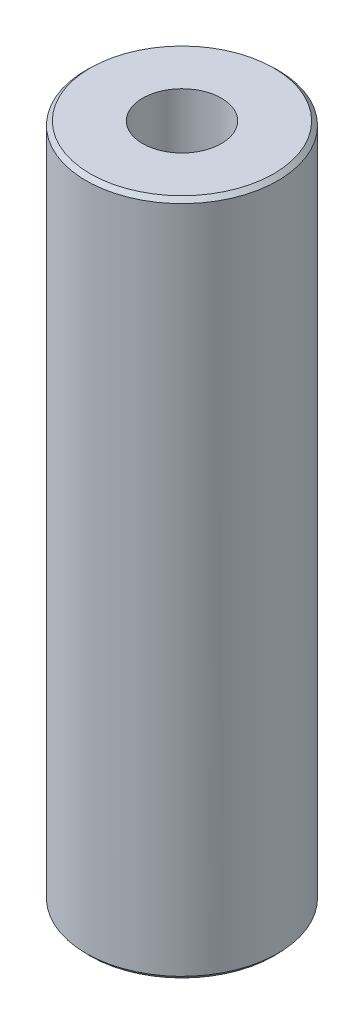
ISO-10303-21;
HEADER;
FILE_DESCRIPTION(('STEP AP214'),'2;1');
FILE_NAME('part.step','',(''),(''),'','','');
FILE_SCHEMA(('AUTOMOTIVE_DESIGN { 1 0 10303 214 1 1 1 1 }'));
ENDSEC;
DATA;
#1=APPLICATION_CONTEXT('core data for automotive mechanical design processes');
#2=APPLICATION_PROTOCOL_DEFINITION('international standard','automotive_design',2000,#1);
#3=PRODUCT_CONTEXT('',#1,'mechanical');
#4=PRODUCT('Part','Part','',(#3));
#5=PRODUCT_RELATED_PRODUCT_CATEGORY('part','',(#4));
#6=PRODUCT_DEFINITION_FORMATION('','',#4);
#7=PRODUCT_DEFINITION_CONTEXT('part definition',#1,'design');
#8=PRODUCT_DEFINITION('design','',#6,#7);
#9=PRODUCT_DEFINITION_SHAPE('','',#8);
#10=(LENGTH_UNIT() NAMED_UNIT(*) SI_UNIT(.MILLI.,.METRE.));
#11=(NAMED_UNIT(*) PLANE_ANGLE_UNIT() SI_UNIT($,.RADIAN.));
#12=(NAMED_UNIT(*) SI_UNIT($,.STERADIAN.) SOLID_ANGLE_UNIT());
#13=UNCERTAINTY_MEASURE_WITH_UNIT(LENGTH_MEASURE(1.E-05),#10,'distance_accuracy_value','');
#14=(GEOMETRIC_REPRESENTATION_CONTEXT(3) GLOBAL_UNCERTAINTY_ASSIGNED_CONTEXT((#13)) GLOBAL_UNIT_ASSIGNED_CONTEXT((#10,
#11,#12)) REPRESENTATION_CONTEXT('',''));
#15=CARTESIAN_POINT('',(0.,0.,0.));
#16=DIRECTION('',(0.,0.,1.));
#17=DIRECTION('',(1.,0.,0.));
#18=AXIS2_PLACEMENT_3D('',#15,#16,#17);
#19=CARTESIAN_POINT('',(0.,317.914214538559,0.));
#20=DIRECTION('',(0.,-1.,0.));
#21=DIRECTION('',(0.,0.,-1.));
#22=AXIS2_PLACEMENT_3D('',#19,#20,#21);
#23=CYLINDRICAL_SURFACE('',#22,45.);
#24=CARTESIAN_POINT('',(0.,316.079445148063,0.));
#25=DIRECTION('',(0.,1.,0.));
#26=DIRECTION('',(0.,0.,1.));
#27=AXIS2_PLACEMENT_3D('',#24,#25,#26);
#28=CIRCLE('',#27,45.);
#29=CARTESIAN_POINT('',(0.,316.079445148063,-45.));
#30=VERTEX_POINT('',#29);
#31=EDGE_CURVE('E50',#30,#30,#28,.F.);
#32=ORIENTED_EDGE('',*,*,#31,.T.);
#33=EDGE_LOOP('',(#32));
#34=FACE_BOUND('',#33,.T.);
#35=CARTESIAN_POINT('',(0.,1.95768399848506,0.));
#36=DIRECTION('',(0.,1.,0.));
#37=DIRECTION('',(0.,0.,1.));
#38=AXIS2_PLACEMENT_3D('',#35,#36,#37);
#39=CIRCLE('',#38,45.);
#40=CARTESIAN_POINT('',(0.,1.95768399848506,45.));
#41=VERTEX_POINT('',#40);
#42=EDGE_CURVE('E51',#41,#41,#39,.T.);
#43=ORIENTED_EDGE('',*,*,#42,.T.);
#44=EDGE_LOOP('',(#43));
#45=FACE_BOUND('',#44,.T.);
#46=ADVANCED_FACE('F39',(#34,#45),#23,.T.);
#47=CARTESIAN_POINT('',(0.,317.914214538559,0.));
#48=DIRECTION('',(0.,1.,0.));
#49=DIRECTION('',(0.,0.,1.));
#50=AXIS2_PLACEMENT_3D('',#47,#48,#49);
#51=PLANE('',#50);
#52=CARTESIAN_POINT('',(0.,317.914214538559,0.));
#53=DIRECTION('',(0.,1.,0.));
#54=DIRECTION('',(0.,0.,1.));
#55=AXIS2_PLACEMENT_3D('',#52,#53,#54);
#56=CIRCLE('',#55,43.0423160015149);
#57=CARTESIAN_POINT('',(0.,317.914214538559,-43.042316001515));
#58=VERTEX_POINT('',#57);
#59=EDGE_CURVE('E54',#58,#58,#56,.T.);
#60=ORIENTED_EDGE('',*,*,#59,.T.);
#61=EDGE_LOOP('',(#60));
#62=FACE_BOUND('',#61,.T.);
#63=CARTESIAN_POINT('',(0.,317.914214538559,0.));
#64=DIRECTION('',(0.,1.,0.));
#65=DIRECTION('',(0.,0.,1.));
#66=AXIS2_PLACEMENT_3D('',#63,#64,#65);
#67=CIRCLE('',#66,18.4985503559406);
#68=CARTESIAN_POINT('',(0.,317.914214538559,18.4985503559406));
#69=VERTEX_POINT('',#68);
#70=EDGE_CURVE('E58',#69,#69,#67,.T.);
#71=ORIENTED_EDGE('',*,*,#70,.F.);
#72=EDGE_LOOP('',(#71));
#73=FACE_BOUND('',#72,.T.);
#74=ADVANCED_FACE('F69',(#62,#73),#51,.T.);
#75=CARTESIAN_POINT('',(0.,0.,0.));
#76=DIRECTION('',(0.,1.,0.));
#77=DIRECTION('',(0.,0.,1.));
#78=AXIS2_PLACEMENT_3D('',#75,#76,#77);
#79=PLANE('',#78);
#80=CARTESIAN_POINT('',(0.,0.,0.));
#81=DIRECTION('',(0.,1.,0.));
#82=DIRECTION('',(0.,0.,1.));
#83=AXIS2_PLACEMENT_3D('',#80,#81,#82);
#84=CIRCLE('',#83,43.1652306095043);
#85=CARTESIAN_POINT('',(0.,0.,43.1652306095043));
#86=VERTEX_POINT('',#85);
#87=EDGE_CURVE('E10',#86,#86,#84,.F.);
#88=ORIENTED_EDGE('',*,*,#87,.T.);
#89=EDGE_LOOP('',(#88));
#90=FACE_BOUND('',#89,.T.);
#91=CARTESIAN_POINT('',(0.,0.,0.));
#92=DIRECTION('',(0.,1.,0.));
#93=DIRECTION('',(0.,0.,1.));
#94=AXIS2_PLACEMENT_3D('',#91,#92,#93);
#95=CIRCLE('',#94,18.4985503559406);
#96=CARTESIAN_POINT('',(0.,0.,18.4985503559406));
#97=VERTEX_POINT('',#96);
#98=EDGE_CURVE('E63',#97,#97,#95,.T.);
#99=ORIENTED_EDGE('',*,*,#98,.T.);
#100=EDGE_LOOP('',(#99));
#101=FACE_BOUND('',#100,.T.);
#102=ADVANCED_FACE('F75',(#90,#101),#79,.F.);
#103=CARTESIAN_POINT('',(0.,317.914214538559,0.));
#104=DIRECTION('',(0.,-1.,0.));
#105=DIRECTION('',(0.,0.,-1.));
#106=AXIS2_PLACEMENT_3D('',#103,#104,#105);
#107=CYLINDRICAL_SURFACE('',#106,18.4985503559406);
#108=ORIENTED_EDGE('',*,*,#70,.T.);
#109=EDGE_LOOP('',(#108));
#110=FACE_BOUND('',#109,.T.);
#111=ORIENTED_EDGE('',*,*,#98,.F.);
#112=EDGE_LOOP('',(#111));
#113=FACE_BOUND('',#112,.T.);
#114=ADVANCED_FACE('F70',(#110,#113),#107,.F.);
#115=CARTESIAN_POINT('',(0.,317.914214538559,0.));
#116=DIRECTION('',(0.,-1.,0.));
#117=DIRECTION('',(0.,0.,-1.));
#118=AXIS2_PLACEMENT_3D('',#115,#116,#117);
#119=CONICAL_SURFACE('',#118,43.0423160015149,0.817797137049059);
#120=CARTESIAN_POINT('',(0.,316.079445148063,-45.));
#121=CARTESIAN_POINT('',(0.,316.098557329214,-44.9796074583492));
#122=CARTESIAN_POINT('',(0.,316.117669510365,-44.9592149166983));
#123=CARTESIAN_POINT('',(0.,316.155893872667,-44.9184298333965));
#124=CARTESIAN_POINT('',(0.,316.175006053818,-44.8980372917456));
#125=CARTESIAN_POINT('',(0.,316.21323041612,-44.8572522084438));
#126=CARTESIAN_POINT('',(0.,316.232342597271,-44.8368596667929));
#127=CARTESIAN_POINT('',(0.,316.270566959573,-44.7960745834912));
#128=CARTESIAN_POINT('',(0.,316.289679140724,-44.7756820418403));
#129=CARTESIAN_POINT('',(0.,316.327903503026,-44.7348969585385));
#130=CARTESIAN_POINT('',(0.,316.347015684177,-44.7145044168876));
#131=CARTESIAN_POINT('',(0.,316.385240046479,-44.6737193335859));
#132=CARTESIAN_POINT('',(0.,316.40435222763,-44.653326791935));
#133=CARTESIAN_POINT('',(0.,316.442576589932,-44.6125417086332));
#134=CARTESIAN_POINT('',(0.,316.461688771083,-44.5921491669823));
#135=CARTESIAN_POINT('',(0.,316.499913133385,-44.5513640836805));
#136=CARTESIAN_POINT('',(0.,316.519025314536,-44.5309715420296));
#137=CARTESIAN_POINT('',(0.,316.557249676838,-44.4901864587279));
#138=CARTESIAN_POINT('',(0.,316.576361857989,-44.469793917077));
#139=CARTESIAN_POINT('',(0.,316.614586220291,-44.4290088337752));
#140=CARTESIAN_POINT('',(0.,316.633698401442,-44.4086162921243));
#141=CARTESIAN_POINT('',(0.,316.671922763744,-44.3678312088226));
#142=CARTESIAN_POINT('',(0.,316.691034944895,-44.3474386671717));
#143=CARTESIAN_POINT('',(0.,316.729259307197,-44.3066535838699));
#144=CARTESIAN_POINT('',(0.,316.748371488348,-44.286261042219));
#145=CARTESIAN_POINT('',(0.,316.78659585065,-44.2454759589172));
#146=CARTESIAN_POINT('',(0.,316.805708031801,-44.2250834172664));
#147=CARTESIAN_POINT('',(0.,316.843932394103,-44.1842983339646));
#148=CARTESIAN_POINT('',(0.,316.863044575254,-44.1639057923137));
#149=CARTESIAN_POINT('',(0.,316.901268937556,-44.1231207090119));
#150=CARTESIAN_POINT('',(0.,316.920381118707,-44.102728167361));
#151=CARTESIAN_POINT('',(0.,316.958605481009,-44.0619430840593));
#152=CARTESIAN_POINT('',(0.,316.97771766216,-44.0415505424084));
#153=CARTESIAN_POINT('',(0.,317.015942024462,-44.0007654591066));
#154=CARTESIAN_POINT('',(0.,317.035054205613,-43.9803729174557));
#155=CARTESIAN_POINT('',(0.,317.073278567915,-43.9395878341539));
#156=CARTESIAN_POINT('',(0.,317.092390749066,-43.9191952925031));
#157=CARTESIAN_POINT('',(0.,317.130615111368,-43.8784102092013));
#158=CARTESIAN_POINT('',(0.,317.149727292519,-43.8580176675504));
#159=CARTESIAN_POINT('',(0.,317.187951654821,-43.8172325842486));
#160=CARTESIAN_POINT('',(0.,317.207063835972,-43.7968400425978));
#161=CARTESIAN_POINT('',(0.,317.245288198274,-43.756054959296));
#162=CARTESIAN_POINT('',(0.,317.264400379425,-43.7356624176451));
#163=CARTESIAN_POINT('',(0.,317.302624741727,-43.6948773343433));
#164=CARTESIAN_POINT('',(0.,317.321736922878,-43.6744847926924));
#165=CARTESIAN_POINT('',(0.,317.35996128518,-43.6336997093907));
#166=CARTESIAN_POINT('',(0.,317.379073466331,-43.6133071677398));
#167=CARTESIAN_POINT('',(0.,317.417297828633,-43.572522084438));
#168=CARTESIAN_POINT('',(0.,317.436410009784,-43.5521295427871));
#169=CARTESIAN_POINT('',(0.,317.474634372086,-43.5113444594853));
#170=CARTESIAN_POINT('',(0.,317.493746553237,-43.4909519178344));
#171=CARTESIAN_POINT('',(0.,317.531970915539,-43.4501668345327));
#172=CARTESIAN_POINT('',(0.,317.55108309669,-43.4297742928818));
#173=CARTESIAN_POINT('',(0.,317.589307458992,-43.38898920958));
#174=CARTESIAN_POINT('',(0.,317.608419640143,-43.3685966679291));
#175=CARTESIAN_POINT('',(0.,317.646644002445,-43.3278115846274));
#176=CARTESIAN_POINT('',(0.,317.665756183596,-43.3074190429765));
#177=CARTESIAN_POINT('',(0.,317.703980545898,-43.2666339596747));
#178=CARTESIAN_POINT('',(0.,317.723092727049,-43.2462414180238));
#179=CARTESIAN_POINT('',(0.,317.761317089351,-43.205456334722));
#180=CARTESIAN_POINT('',(0.,317.780429270502,-43.1850637930712));
#181=CARTESIAN_POINT('',(0.,317.818653632804,-43.1442787097694));
#182=CARTESIAN_POINT('',(0.,317.837765813955,-43.1238861681185));
#183=CARTESIAN_POINT('',(0.,317.875990176257,-43.0831010848167));
#184=CARTESIAN_POINT('',(0.,317.895102357408,-43.0627085431658));
#185=CARTESIAN_POINT('',(0.,317.914214538559,-43.042316001515));
#186=B_SPLINE_CURVE_WITH_KNOTS('',3,(#120,#121,#122,#123,#124,#125,#126,#127,#128,#129,#130,
#131,#132,#133,#134,#135,#136,#137,#138,#139,#140,#141,#142,#143,#144,#145,#146,#147,#148,#149,
#150,#151,#152,#153,#154,#155,#156,#157,#158,#159,#160,#161,#162,#163,#164,#165,#166,#167,#168,
#169,#170,#171,#172,#173,#174,#175,#176,#177,#178,#179,#180,#181,#182,#183,#184,#185),
.UNSPECIFIED.,.F.,.F.,(4,2,2,2,2,2,2,2,2,2,2,2,2,2,2,2,2,2,2,2,2,2,2,2,2,2,2,2,2,2,2,2,4),(0.,
0.0838461746890208,0.167692349378047,0.25153852406711,0.335384698756131,0.419230873445195,
0.503077048134216,0.58692322282328,0.670769397512305,0.754615572201364,0.83846174689039,
0.922307921579449,1.00615409626847,1.09000027095753,1.17384644564656,1.25769262033562,
1.34153879502464,1.42538496971367,1.50923114440273,1.59307731909175,1.67692349378082,
1.76076966846984,1.8446158431589,1.92846201784792,2.01230819253699,2.09615436722601,
2.18000054191507,2.2638467166041,2.34769289129316,2.43153906598218,2.51538524067125,
2.59923141536027,2.68307759004933),.UNSPECIFIED.);
#187=EDGE_CURVE('BSEAM81',#30,#58,#186,.T.);
#188=ORIENTED_EDGE('',*,*,#31,.F.);
#189=ORIENTED_EDGE('',*,*,#59,.F.);
#190=ORIENTED_EDGE('',*,*,#187,.T.);
#191=ORIENTED_EDGE('',*,*,#187,.F.);
#192=EDGE_LOOP('',(#188,#190,#189,#191));
#193=FACE_BOUND('',#192,.T.);
#194=ADVANCED_FACE('F81',(#193),#119,.T.);
#195=CARTESIAN_POINT('',(0.,1.95768399848506,0.));
#196=DIRECTION('',(0.,1.,0.));
#197=DIRECTION('',(0.,0.,1.));
#198=AXIS2_PLACEMENT_3D('',#195,#196,#197);
#199=CONICAL_SURFACE('',#198,45.,0.752999189745813);
#200=ORIENTED_EDGE('',*,*,#87,.F.);
#201=EDGE_LOOP('',(#200));
#202=FACE_BOUND('',#201,.T.);
#203=ORIENTED_EDGE('',*,*,#42,.F.);
#204=EDGE_LOOP('',(#203));
#205=FACE_BOUND('',#204,.T.);
#206=ADVANCED_FACE('F45',(#202,#205),#199,.T.);
#207=CLOSED_SHELL('',(#46,#74,#102,#114,#194,#206));
#208=MANIFOLD_SOLID_BREP('B2',#207);
#209=ADVANCED_BREP_SHAPE_REPRESENTATION('',(#18,#208),#14);
#210=SHAPE_DEFINITION_REPRESENTATION(#9,#209);
ENDSEC;
END-ISO-10303-21;
